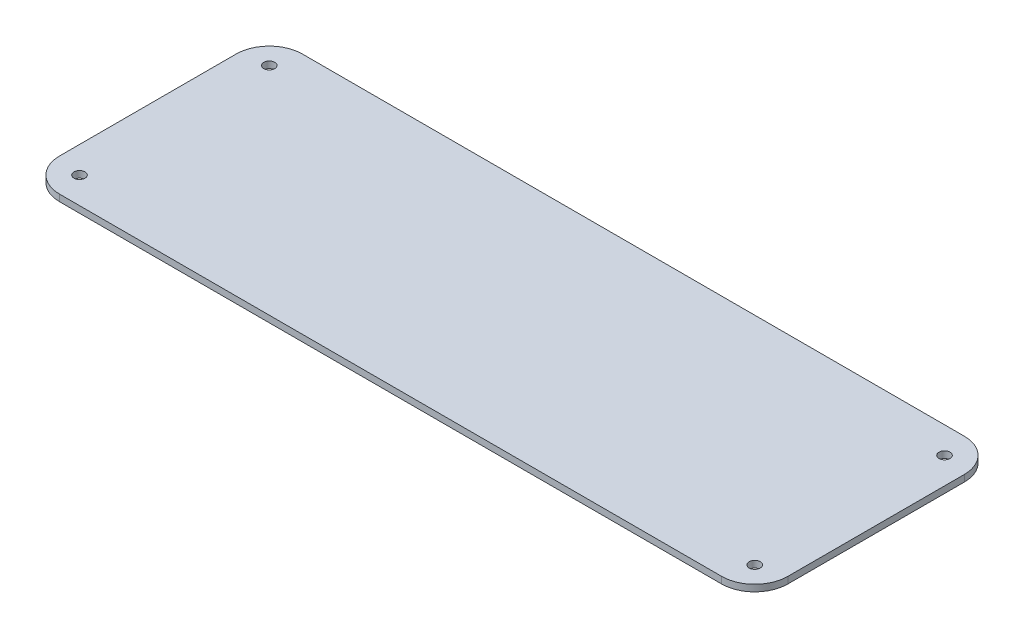
ISO-10303-21;
HEADER;
FILE_DESCRIPTION(('STEP AP214'),'2;1');
FILE_NAME('part.step','',(''),(''),'','','');
FILE_SCHEMA(('AUTOMOTIVE_DESIGN { 1 0 10303 214 1 1 1 1 }'));
ENDSEC;
DATA;
#1=APPLICATION_CONTEXT('core data for automotive mechanical design processes');
#2=APPLICATION_PROTOCOL_DEFINITION('international standard','automotive_design',2000,#1);
#3=PRODUCT_CONTEXT('',#1,'mechanical');
#4=PRODUCT('Part','Part','',(#3));
#5=PRODUCT_RELATED_PRODUCT_CATEGORY('part','',(#4));
#6=PRODUCT_DEFINITION_FORMATION('','',#4);
#7=PRODUCT_DEFINITION_CONTEXT('part definition',#1,'design');
#8=PRODUCT_DEFINITION('design','',#6,#7);
#9=PRODUCT_DEFINITION_SHAPE('','',#8);
#10=(LENGTH_UNIT() NAMED_UNIT(*) SI_UNIT(.MILLI.,.METRE.));
#11=(NAMED_UNIT(*) PLANE_ANGLE_UNIT() SI_UNIT($,.RADIAN.));
#12=(NAMED_UNIT(*) SI_UNIT($,.STERADIAN.) SOLID_ANGLE_UNIT());
#13=UNCERTAINTY_MEASURE_WITH_UNIT(LENGTH_MEASURE(1.E-05),#10,'distance_accuracy_value','');
#14=(GEOMETRIC_REPRESENTATION_CONTEXT(3) GLOBAL_UNCERTAINTY_ASSIGNED_CONTEXT((#13)) GLOBAL_UNIT_ASSIGNED_CONTEXT((#10,
#11,#12)) REPRESENTATION_CONTEXT('',''));
#15=CARTESIAN_POINT('',(0.,0.,0.));
#16=DIRECTION('',(0.,0.,1.));
#17=DIRECTION('',(1.,0.,0.));
#18=AXIS2_PLACEMENT_3D('',#15,#16,#17);
#19=CARTESIAN_POINT('',(0.,3.,-110.));
#20=DIRECTION('',(0.,-1.,0.));
#21=DIRECTION('',(0.,0.,-1.));
#22=AXIS2_PLACEMENT_3D('',#19,#20,#21);
#23=PLANE('',#22);
#24=CARTESIAN_POINT('',(318.,3.,-12.));
#25=DIRECTION('',(0.,1.,0.));
#26=DIRECTION('',(0.,0.,1.));
#27=AXIS2_PLACEMENT_3D('',#24,#25,#26);
#28=CIRCLE('',#27,2.50000000000002);
#29=CARTESIAN_POINT('',(318.,3.,-9.49999999999997));
#30=VERTEX_POINT('',#29);
#31=EDGE_CURVE('E182',#30,#30,#28,.T.);
#32=ORIENTED_EDGE('',*,*,#31,.F.);
#33=EDGE_LOOP('',(#32));
#34=FACE_BOUND('',#33,.T.);
#35=CARTESIAN_POINT('',(12.,3.,-98.));
#36=DIRECTION('',(0.,1.,0.));
#37=DIRECTION('',(0.,0.,1.));
#38=AXIS2_PLACEMENT_3D('',#35,#36,#37);
#39=CIRCLE('',#38,2.5);
#40=CARTESIAN_POINT('',(12.,3.,-95.5));
#41=VERTEX_POINT('',#40);
#42=EDGE_CURVE('E124',#41,#41,#39,.T.);
#43=ORIENTED_EDGE('',*,*,#42,.F.);
#44=EDGE_LOOP('',(#43));
#45=FACE_BOUND('',#44,.T.);
#46=DIRECTION('',(-1.,0.,0.));
#47=VECTOR('',#46,1.);
#48=CARTESIAN_POINT('',(0.,3.,-110.));
#49=LINE('',#48,#47);
#50=CARTESIAN_POINT('',(315.,3.,-110.));
#51=VERTEX_POINT('',#50);
#52=CARTESIAN_POINT('',(15.,3.,-110.));
#53=VERTEX_POINT('',#52);
#54=EDGE_CURVE('E133',#51,#53,#49,.T.);
#55=ORIENTED_EDGE('',*,*,#54,.T.);
#56=CARTESIAN_POINT('',(15.,3.,-95.));
#57=DIRECTION('',(0.,-1.,0.));
#58=DIRECTION('',(0.,0.,-1.));
#59=AXIS2_PLACEMENT_3D('',#56,#57,#58);
#60=CIRCLE('',#59,15.);
#61=CARTESIAN_POINT('',(0.,3.,-95.));
#62=VERTEX_POINT('',#61);
#63=EDGE_CURVE('E152',#53,#62,#60,.F.);
#64=ORIENTED_EDGE('',*,*,#63,.T.);
#65=DIRECTION('',(0.,0.,1.));
#66=VECTOR('',#65,1.);
#67=CARTESIAN_POINT('',(0.,3.,0.));
#68=LINE('',#67,#66);
#69=CARTESIAN_POINT('',(0.,3.,-15.));
#70=VERTEX_POINT('',#69);
#71=EDGE_CURVE('E116',#62,#70,#68,.T.);
#72=ORIENTED_EDGE('',*,*,#71,.T.);
#73=CARTESIAN_POINT('',(15.,3.,-15.));
#74=DIRECTION('',(0.,-1.,0.));
#75=DIRECTION('',(0.,0.,-1.));
#76=AXIS2_PLACEMENT_3D('',#73,#74,#75);
#77=CIRCLE('',#76,15.);
#78=CARTESIAN_POINT('',(15.,3.,0.));
#79=VERTEX_POINT('',#78);
#80=EDGE_CURVE('E150',#70,#79,#77,.F.);
#81=ORIENTED_EDGE('',*,*,#80,.T.);
#82=DIRECTION('',(1.,0.,0.));
#83=VECTOR('',#82,1.);
#84=CARTESIAN_POINT('',(0.,3.,0.));
#85=LINE('',#84,#83);
#86=CARTESIAN_POINT('',(315.,3.,0.));
#87=VERTEX_POINT('',#86);
#88=EDGE_CURVE('E172',#79,#87,#85,.T.);
#89=ORIENTED_EDGE('',*,*,#88,.T.);
#90=CARTESIAN_POINT('',(315.,3.,-15.));
#91=DIRECTION('',(0.,-1.,0.));
#92=DIRECTION('',(0.,0.,-1.));
#93=AXIS2_PLACEMENT_3D('',#90,#91,#92);
#94=CIRCLE('',#93,15.);
#95=CARTESIAN_POINT('',(330.,3.,-15.));
#96=VERTEX_POINT('',#95);
#97=EDGE_CURVE('E51',#87,#96,#94,.F.);
#98=ORIENTED_EDGE('',*,*,#97,.T.);
#99=DIRECTION('',(0.,0.,-1.));
#100=VECTOR('',#99,1.);
#101=CARTESIAN_POINT('',(330.,3.,0.));
#102=LINE('',#101,#100);
#103=CARTESIAN_POINT('',(330.,3.,-95.));
#104=VERTEX_POINT('',#103);
#105=EDGE_CURVE('E162',#96,#104,#102,.T.);
#106=ORIENTED_EDGE('',*,*,#105,.T.);
#107=CARTESIAN_POINT('',(315.,3.,-95.));
#108=DIRECTION('',(0.,-1.,0.));
#109=DIRECTION('',(0.,0.,-1.));
#110=AXIS2_PLACEMENT_3D('',#107,#108,#109);
#111=CIRCLE('',#110,15.);
#112=EDGE_CURVE('E148',#104,#51,#111,.F.);
#113=ORIENTED_EDGE('',*,*,#112,.T.);
#114=EDGE_LOOP('',(#55,#64,#72,#81,#89,#98,#106,#113));
#115=FACE_BOUND('',#114,.T.);
#116=CARTESIAN_POINT('',(318.,3.,-98.));
#117=DIRECTION('',(0.,1.,0.));
#118=DIRECTION('',(0.,0.,-1.));
#119=AXIS2_PLACEMENT_3D('',#116,#117,#118);
#120=CIRCLE('',#119,2.50000000000002);
#121=CARTESIAN_POINT('',(318.,3.,-100.5));
#122=VERTEX_POINT('',#121);
#123=EDGE_CURVE('E177',#122,#122,#120,.T.);
#124=ORIENTED_EDGE('',*,*,#123,.F.);
#125=EDGE_LOOP('',(#124));
#126=FACE_BOUND('',#125,.T.);
#127=CARTESIAN_POINT('',(12.,3.,-12.));
#128=DIRECTION('',(0.,1.,0.));
#129=DIRECTION('',(0.,0.,-1.));
#130=AXIS2_PLACEMENT_3D('',#127,#128,#129);
#131=CIRCLE('',#130,2.5);
#132=CARTESIAN_POINT('',(12.,3.,-14.5));
#133=VERTEX_POINT('',#132);
#134=EDGE_CURVE('E188',#133,#133,#131,.T.);
#135=ORIENTED_EDGE('',*,*,#134,.F.);
#136=EDGE_LOOP('',(#135));
#137=FACE_BOUND('',#136,.T.);
#138=ADVANCED_FACE('F31',(#34,#45,#115,#126,#137),#23,.F.);
#139=CARTESIAN_POINT('',(0.,0.,-110.));
#140=DIRECTION('',(0.,-1.,0.));
#141=DIRECTION('',(0.,0.,-1.));
#142=AXIS2_PLACEMENT_3D('',#139,#140,#141);
#143=PLANE('',#142);
#144=CARTESIAN_POINT('',(318.,0.,-12.));
#145=DIRECTION('',(0.,1.,0.));
#146=DIRECTION('',(0.,0.,1.));
#147=AXIS2_PLACEMENT_3D('',#144,#145,#146);
#148=CIRCLE('',#147,2.50000000000002);
#149=CARTESIAN_POINT('',(318.,0.,-9.49999999999997));
#150=VERTEX_POINT('',#149);
#151=EDGE_CURVE('E185',#150,#150,#148,.T.);
#152=ORIENTED_EDGE('',*,*,#151,.T.);
#153=EDGE_LOOP('',(#152));
#154=FACE_BOUND('',#153,.T.);
#155=CARTESIAN_POINT('',(12.,0.,-98.));
#156=DIRECTION('',(0.,1.,0.));
#157=DIRECTION('',(0.,0.,1.));
#158=AXIS2_PLACEMENT_3D('',#155,#156,#157);
#159=CIRCLE('',#158,2.5);
#160=CARTESIAN_POINT('',(12.,0.,-95.5));
#161=VERTEX_POINT('',#160);
#162=EDGE_CURVE('E130',#161,#161,#159,.T.);
#163=ORIENTED_EDGE('',*,*,#162,.T.);
#164=EDGE_LOOP('',(#163));
#165=FACE_BOUND('',#164,.T.);
#166=DIRECTION('',(0.,0.,1.));
#167=VECTOR('',#166,1.);
#168=CARTESIAN_POINT('',(0.,0.,0.));
#169=LINE('',#168,#167);
#170=CARTESIAN_POINT('',(0.,0.,-95.));
#171=VERTEX_POINT('',#170);
#172=CARTESIAN_POINT('',(0.,0.,-15.));
#173=VERTEX_POINT('',#172);
#174=EDGE_CURVE('E113',#171,#173,#169,.T.);
#175=ORIENTED_EDGE('',*,*,#174,.F.);
#176=CARTESIAN_POINT('',(15.,0.,-95.));
#177=DIRECTION('',(0.,-1.,0.));
#178=DIRECTION('',(0.,0.,-1.));
#179=AXIS2_PLACEMENT_3D('',#176,#177,#178);
#180=CIRCLE('',#179,15.);
#181=CARTESIAN_POINT('',(15.,0.,-110.));
#182=VERTEX_POINT('',#181);
#183=EDGE_CURVE('E96',#171,#182,#180,.T.);
#184=ORIENTED_EDGE('',*,*,#183,.T.);
#185=DIRECTION('',(-1.,0.,0.));
#186=VECTOR('',#185,1.);
#187=CARTESIAN_POINT('',(0.,0.,-110.));
#188=LINE('',#187,#186);
#189=CARTESIAN_POINT('',(315.,0.,-110.));
#190=VERTEX_POINT('',#189);
#191=EDGE_CURVE('E137',#190,#182,#188,.T.);
#192=ORIENTED_EDGE('',*,*,#191,.F.);
#193=CARTESIAN_POINT('',(315.,0.,-95.));
#194=DIRECTION('',(0.,-1.,0.));
#195=DIRECTION('',(0.,0.,-1.));
#196=AXIS2_PLACEMENT_3D('',#193,#194,#195);
#197=CIRCLE('',#196,15.);
#198=CARTESIAN_POINT('',(330.,0.,-95.));
#199=VERTEX_POINT('',#198);
#200=EDGE_CURVE('E141',#190,#199,#197,.T.);
#201=ORIENTED_EDGE('',*,*,#200,.T.);
#202=DIRECTION('',(0.,0.,-1.));
#203=VECTOR('',#202,1.);
#204=CARTESIAN_POINT('',(330.,0.,0.));
#205=LINE('',#204,#203);
#206=CARTESIAN_POINT('',(330.,0.,-15.));
#207=VERTEX_POINT('',#206);
#208=EDGE_CURVE('E127',#207,#199,#205,.T.);
#209=ORIENTED_EDGE('',*,*,#208,.F.);
#210=CARTESIAN_POINT('',(315.,0.,-15.));
#211=DIRECTION('',(0.,-1.,0.));
#212=DIRECTION('',(0.,0.,-1.));
#213=AXIS2_PLACEMENT_3D('',#210,#211,#212);
#214=CIRCLE('',#213,15.);
#215=CARTESIAN_POINT('',(315.,0.,0.));
#216=VERTEX_POINT('',#215);
#217=EDGE_CURVE('E117',#207,#216,#214,.T.);
#218=ORIENTED_EDGE('',*,*,#217,.T.);
#219=DIRECTION('',(1.,0.,0.));
#220=VECTOR('',#219,1.);
#221=CARTESIAN_POINT('',(0.,0.,0.));
#222=LINE('',#221,#220);
#223=CARTESIAN_POINT('',(15.,0.,0.));
#224=VERTEX_POINT('',#223);
#225=EDGE_CURVE('E123',#224,#216,#222,.T.);
#226=ORIENTED_EDGE('',*,*,#225,.F.);
#227=CARTESIAN_POINT('',(15.,0.,-15.));
#228=DIRECTION('',(0.,-1.,0.));
#229=DIRECTION('',(0.,0.,-1.));
#230=AXIS2_PLACEMENT_3D('',#227,#228,#229);
#231=CIRCLE('',#230,15.);
#232=EDGE_CURVE('E107',#224,#173,#231,.T.);
#233=ORIENTED_EDGE('',*,*,#232,.T.);
#234=EDGE_LOOP('',(#175,#184,#192,#201,#209,#218,#226,#233));
#235=FACE_BOUND('',#234,.T.);
#236=CARTESIAN_POINT('',(318.,0.,-98.));
#237=DIRECTION('',(0.,1.,0.));
#238=DIRECTION('',(0.,0.,-1.));
#239=AXIS2_PLACEMENT_3D('',#236,#237,#238);
#240=CIRCLE('',#239,2.50000000000002);
#241=CARTESIAN_POINT('',(318.,0.,-100.5));
#242=VERTEX_POINT('',#241);
#243=EDGE_CURVE('E179',#242,#242,#240,.T.);
#244=ORIENTED_EDGE('',*,*,#243,.T.);
#245=EDGE_LOOP('',(#244));
#246=FACE_BOUND('',#245,.T.);
#247=CARTESIAN_POINT('',(12.,0.,-12.));
#248=DIRECTION('',(0.,1.,0.));
#249=DIRECTION('',(0.,0.,-1.));
#250=AXIS2_PLACEMENT_3D('',#247,#248,#249);
#251=CIRCLE('',#250,2.5);
#252=CARTESIAN_POINT('',(12.,0.,-14.5));
#253=VERTEX_POINT('',#252);
#254=EDGE_CURVE('E191',#253,#253,#251,.T.);
#255=ORIENTED_EDGE('',*,*,#254,.T.);
#256=EDGE_LOOP('',(#255));
#257=FACE_BOUND('',#256,.T.);
#258=ADVANCED_FACE('F120',(#154,#165,#235,#246,#257),#143,.T.);
#259=CARTESIAN_POINT('',(0.,3.,0.));
#260=DIRECTION('',(1.,0.,0.));
#261=DIRECTION('',(0.,0.,-1.));
#262=AXIS2_PLACEMENT_3D('',#259,#260,#261);
#263=PLANE('',#262);
#264=ORIENTED_EDGE('',*,*,#71,.F.);
#265=DIRECTION('',(0.,-1.,0.));
#266=VECTOR('',#265,1.);
#267=CARTESIAN_POINT('',(0.,3.,-95.));
#268=LINE('',#267,#266);
#269=EDGE_CURVE('E100',#62,#171,#268,.T.);
#270=ORIENTED_EDGE('',*,*,#269,.T.);
#271=ORIENTED_EDGE('',*,*,#174,.T.);
#272=DIRECTION('',(0.,-1.,0.));
#273=VECTOR('',#272,1.);
#274=CARTESIAN_POINT('',(0.,3.,-15.));
#275=LINE('',#274,#273);
#276=EDGE_CURVE('E118',#173,#70,#275,.F.);
#277=ORIENTED_EDGE('',*,*,#276,.T.);
#278=EDGE_LOOP('',(#264,#270,#271,#277));
#279=FACE_BOUND('',#278,.T.);
#280=ADVANCED_FACE('F112',(#279),#263,.F.);
#281=CARTESIAN_POINT('',(0.,3.,0.));
#282=DIRECTION('',(0.,0.,-1.));
#283=DIRECTION('',(-1.,0.,0.));
#284=AXIS2_PLACEMENT_3D('',#281,#282,#283);
#285=PLANE('',#284);
#286=ORIENTED_EDGE('',*,*,#88,.F.);
#287=DIRECTION('',(0.,-1.,0.));
#288=VECTOR('',#287,1.);
#289=CARTESIAN_POINT('',(15.,3.,0.));
#290=LINE('',#289,#288);
#291=EDGE_CURVE('E156',#79,#224,#290,.T.);
#292=ORIENTED_EDGE('',*,*,#291,.T.);
#293=ORIENTED_EDGE('',*,*,#225,.T.);
#294=DIRECTION('',(0.,-1.,0.));
#295=VECTOR('',#294,1.);
#296=CARTESIAN_POINT('',(315.,3.,0.));
#297=LINE('',#296,#295);
#298=EDGE_CURVE('E154',#216,#87,#297,.F.);
#299=ORIENTED_EDGE('',*,*,#298,.T.);
#300=EDGE_LOOP('',(#286,#292,#293,#299));
#301=FACE_BOUND('',#300,.T.);
#302=ADVANCED_FACE('F218',(#301),#285,.F.);
#303=CARTESIAN_POINT('',(330.,3.,0.));
#304=DIRECTION('',(-1.,0.,0.));
#305=DIRECTION('',(0.,0.,1.));
#306=AXIS2_PLACEMENT_3D('',#303,#304,#305);
#307=PLANE('',#306);
#308=ORIENTED_EDGE('',*,*,#208,.T.);
#309=DIRECTION('',(0.,-1.,0.));
#310=VECTOR('',#309,1.);
#311=CARTESIAN_POINT('',(330.,3.,-95.));
#312=LINE('',#311,#310);
#313=EDGE_CURVE('E11',#199,#104,#312,.F.);
#314=ORIENTED_EDGE('',*,*,#313,.T.);
#315=ORIENTED_EDGE('',*,*,#105,.F.);
#316=DIRECTION('',(0.,-1.,0.));
#317=VECTOR('',#316,1.);
#318=CARTESIAN_POINT('',(330.,3.,-15.));
#319=LINE('',#318,#317);
#320=EDGE_CURVE('E39',#96,#207,#319,.T.);
#321=ORIENTED_EDGE('',*,*,#320,.T.);
#322=EDGE_LOOP('',(#308,#314,#315,#321));
#323=FACE_BOUND('',#322,.T.);
#324=ADVANCED_FACE('F161',(#323),#307,.F.);
#325=CARTESIAN_POINT('',(0.,3.,-110.));
#326=DIRECTION('',(0.,0.,1.));
#327=DIRECTION('',(1.,0.,0.));
#328=AXIS2_PLACEMENT_3D('',#325,#326,#327);
#329=PLANE('',#328);
#330=ORIENTED_EDGE('',*,*,#191,.T.);
#331=DIRECTION('',(0.,-1.,0.));
#332=VECTOR('',#331,1.);
#333=CARTESIAN_POINT('',(15.,3.,-110.));
#334=LINE('',#333,#332);
#335=EDGE_CURVE('E101',#182,#53,#334,.F.);
#336=ORIENTED_EDGE('',*,*,#335,.T.);
#337=ORIENTED_EDGE('',*,*,#54,.F.);
#338=DIRECTION('',(0.,-1.,0.));
#339=VECTOR('',#338,1.);
#340=CARTESIAN_POINT('',(315.,3.,-110.));
#341=LINE('',#340,#339);
#342=EDGE_CURVE('E106',#51,#190,#341,.T.);
#343=ORIENTED_EDGE('',*,*,#342,.T.);
#344=EDGE_LOOP('',(#330,#336,#337,#343));
#345=FACE_BOUND('',#344,.T.);
#346=ADVANCED_FACE('F170',(#345),#329,.F.);
#347=CARTESIAN_POINT('',(12.,3.,-98.));
#348=DIRECTION('',(0.,-1.,0.));
#349=DIRECTION('',(0.,0.,-1.));
#350=AXIS2_PLACEMENT_3D('',#347,#348,#349);
#351=CYLINDRICAL_SURFACE('',#350,2.5);
#352=ORIENTED_EDGE('',*,*,#42,.T.);
#353=EDGE_LOOP('',(#352));
#354=FACE_BOUND('',#353,.T.);
#355=ORIENTED_EDGE('',*,*,#162,.F.);
#356=EDGE_LOOP('',(#355));
#357=FACE_BOUND('',#356,.T.);
#358=ADVANCED_FACE('F211',(#354,#357),#351,.F.);
#359=CARTESIAN_POINT('',(318.,3.,-98.));
#360=DIRECTION('',(0.,-1.,0.));
#361=DIRECTION('',(0.,0.,-1.));
#362=AXIS2_PLACEMENT_3D('',#359,#360,#361);
#363=CYLINDRICAL_SURFACE('',#362,2.50000000000002);
#364=ORIENTED_EDGE('',*,*,#123,.T.);
#365=EDGE_LOOP('',(#364));
#366=FACE_BOUND('',#365,.T.);
#367=ORIENTED_EDGE('',*,*,#243,.F.);
#368=EDGE_LOOP('',(#367));
#369=FACE_BOUND('',#368,.T.);
#370=ADVANCED_FACE('F242',(#366,#369),#363,.F.);
#371=CARTESIAN_POINT('',(318.,3.,-12.));
#372=DIRECTION('',(0.,-1.,0.));
#373=DIRECTION('',(0.,0.,-1.));
#374=AXIS2_PLACEMENT_3D('',#371,#372,#373);
#375=CYLINDRICAL_SURFACE('',#374,2.50000000000002);
#376=ORIENTED_EDGE('',*,*,#31,.T.);
#377=EDGE_LOOP('',(#376));
#378=FACE_BOUND('',#377,.T.);
#379=ORIENTED_EDGE('',*,*,#151,.F.);
#380=EDGE_LOOP('',(#379));
#381=FACE_BOUND('',#380,.T.);
#382=ADVANCED_FACE('F245',(#378,#381),#375,.F.);
#383=CARTESIAN_POINT('',(12.,3.,-12.));
#384=DIRECTION('',(0.,-1.,0.));
#385=DIRECTION('',(0.,0.,-1.));
#386=AXIS2_PLACEMENT_3D('',#383,#384,#385);
#387=CYLINDRICAL_SURFACE('',#386,2.5);
#388=ORIENTED_EDGE('',*,*,#134,.T.);
#389=EDGE_LOOP('',(#388));
#390=FACE_BOUND('',#389,.T.);
#391=ORIENTED_EDGE('',*,*,#254,.F.);
#392=EDGE_LOOP('',(#391));
#393=FACE_BOUND('',#392,.T.);
#394=ADVANCED_FACE('F197',(#390,#393),#387,.F.);
#395=CARTESIAN_POINT('',(15.,3.,-95.));
#396=DIRECTION('',(0.,-1.,0.));
#397=DIRECTION('',(0.,0.,-1.));
#398=AXIS2_PLACEMENT_3D('',#395,#396,#397);
#399=CYLINDRICAL_SURFACE('',#398,15.);
#400=ORIENTED_EDGE('',*,*,#63,.F.);
#401=ORIENTED_EDGE('',*,*,#335,.F.);
#402=ORIENTED_EDGE('',*,*,#183,.F.);
#403=ORIENTED_EDGE('',*,*,#269,.F.);
#404=EDGE_LOOP('',(#400,#401,#402,#403));
#405=FACE_BOUND('',#404,.T.);
#406=ADVANCED_FACE('F99',(#405),#399,.T.);
#407=CARTESIAN_POINT('',(15.,3.,-15.));
#408=DIRECTION('',(0.,-1.,0.));
#409=DIRECTION('',(0.,0.,-1.));
#410=AXIS2_PLACEMENT_3D('',#407,#408,#409);
#411=CYLINDRICAL_SURFACE('',#410,15.);
#412=ORIENTED_EDGE('',*,*,#80,.F.);
#413=ORIENTED_EDGE('',*,*,#276,.F.);
#414=ORIENTED_EDGE('',*,*,#232,.F.);
#415=ORIENTED_EDGE('',*,*,#291,.F.);
#416=EDGE_LOOP('',(#412,#413,#414,#415));
#417=FACE_BOUND('',#416,.T.);
#418=ADVANCED_FACE('F226',(#417),#411,.T.);
#419=CARTESIAN_POINT('',(315.,3.,-95.));
#420=DIRECTION('',(0.,-1.,0.));
#421=DIRECTION('',(0.,0.,-1.));
#422=AXIS2_PLACEMENT_3D('',#419,#420,#421);
#423=CYLINDRICAL_SURFACE('',#422,15.);
#424=ORIENTED_EDGE('',*,*,#112,.F.);
#425=ORIENTED_EDGE('',*,*,#313,.F.);
#426=ORIENTED_EDGE('',*,*,#200,.F.);
#427=ORIENTED_EDGE('',*,*,#342,.F.);
#428=EDGE_LOOP('',(#424,#425,#426,#427));
#429=FACE_BOUND('',#428,.T.);
#430=ADVANCED_FACE('F167',(#429),#423,.T.);
#431=CARTESIAN_POINT('',(315.,3.,-15.));
#432=DIRECTION('',(0.,-1.,0.));
#433=DIRECTION('',(0.,0.,-1.));
#434=AXIS2_PLACEMENT_3D('',#431,#432,#433);
#435=CYLINDRICAL_SURFACE('',#434,15.);
#436=ORIENTED_EDGE('',*,*,#97,.F.);
#437=ORIENTED_EDGE('',*,*,#298,.F.);
#438=ORIENTED_EDGE('',*,*,#217,.F.);
#439=ORIENTED_EDGE('',*,*,#320,.F.);
#440=EDGE_LOOP('',(#436,#437,#438,#439));
#441=FACE_BOUND('',#440,.T.);
#442=ADVANCED_FACE('F33',(#441),#435,.T.);
#443=CLOSED_SHELL('',(#138,#258,#280,#302,#324,#346,#358,#370,#382,#394,#406,#418,#430,#442));
#444=MANIFOLD_SOLID_BREP('B2',#443);
#445=ADVANCED_BREP_SHAPE_REPRESENTATION('',(#18,#444),#14);
#446=SHAPE_DEFINITION_REPRESENTATION(#9,#445);
ENDSEC;
END-ISO-10303-21;
